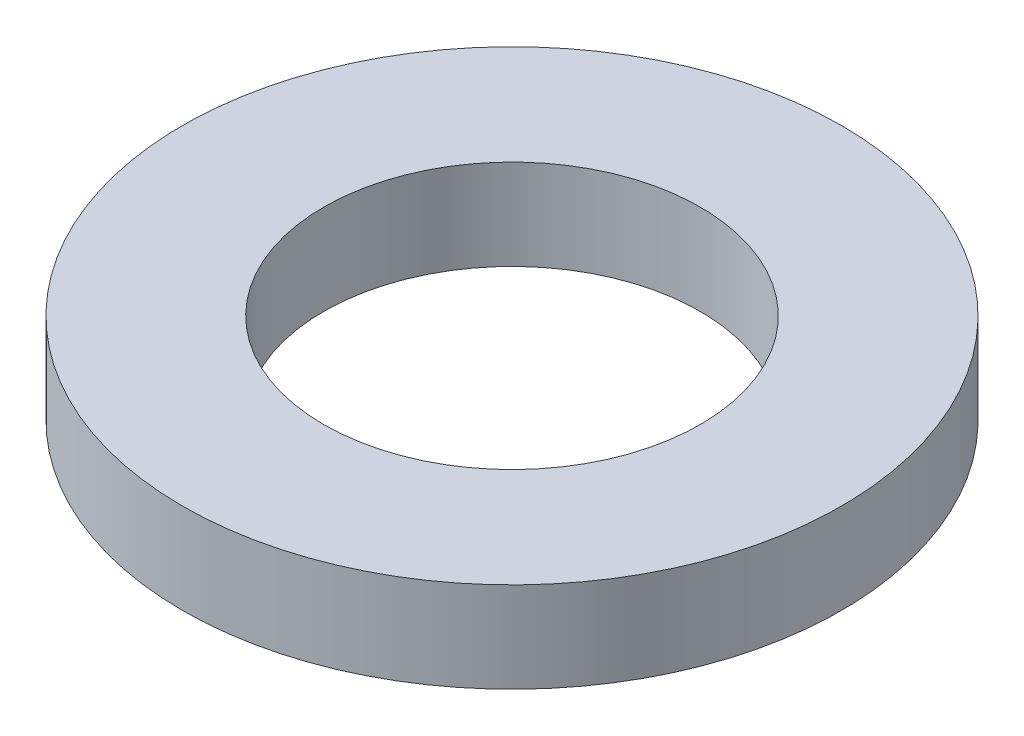
ISO-10303-21;
HEADER;
FILE_DESCRIPTION(('STEP AP214'),'2;1');
FILE_NAME('part.step','',(''),(''),'','','');
FILE_SCHEMA(('AUTOMOTIVE_DESIGN { 1 0 10303 214 1 1 1 1 }'));
ENDSEC;
DATA;
#1=APPLICATION_CONTEXT('core data for automotive mechanical design processes');
#2=APPLICATION_PROTOCOL_DEFINITION('international standard','automotive_design',2000,#1);
#3=PRODUCT_CONTEXT('',#1,'mechanical');
#4=PRODUCT('Part','Part','',(#3));
#5=PRODUCT_RELATED_PRODUCT_CATEGORY('part','',(#4));
#6=PRODUCT_DEFINITION_FORMATION('','',#4);
#7=PRODUCT_DEFINITION_CONTEXT('part definition',#1,'design');
#8=PRODUCT_DEFINITION('design','',#6,#7);
#9=PRODUCT_DEFINITION_SHAPE('','',#8);
#10=(LENGTH_UNIT() NAMED_UNIT(*) SI_UNIT(.MILLI.,.METRE.));
#11=(NAMED_UNIT(*) PLANE_ANGLE_UNIT() SI_UNIT($,.RADIAN.));
#12=(NAMED_UNIT(*) SI_UNIT($,.STERADIAN.) SOLID_ANGLE_UNIT());
#13=UNCERTAINTY_MEASURE_WITH_UNIT(LENGTH_MEASURE(1.E-05),#10,'distance_accuracy_value','');
#14=(GEOMETRIC_REPRESENTATION_CONTEXT(3) GLOBAL_UNCERTAINTY_ASSIGNED_CONTEXT((#13)) GLOBAL_UNIT_ASSIGNED_CONTEXT((#10,
#11,#12)) REPRESENTATION_CONTEXT('',''));
#15=CARTESIAN_POINT('',(0.,0.,0.));
#16=DIRECTION('',(0.,0.,1.));
#17=DIRECTION('',(1.,0.,0.));
#18=AXIS2_PLACEMENT_3D('',#15,#16,#17);
#19=CARTESIAN_POINT('',(0.,24.,0.));
#20=DIRECTION('',(0.,-1.,0.));
#21=DIRECTION('',(0.,0.,-1.));
#22=AXIS2_PLACEMENT_3D('',#19,#20,#21);
#23=CYLINDRICAL_SURFACE('',#22,87.5);
#24=CARTESIAN_POINT('',(0.,24.,0.));
#25=DIRECTION('',(0.,1.,0.));
#26=DIRECTION('',(0.,0.,1.));
#27=AXIS2_PLACEMENT_3D('',#24,#25,#26);
#28=CIRCLE('',#27,87.5);
#29=CARTESIAN_POINT('',(0.,24.,87.5));
#30=VERTEX_POINT('',#29);
#31=EDGE_CURVE('E10',#30,#30,#28,.T.);
#32=ORIENTED_EDGE('',*,*,#31,.F.);
#33=EDGE_LOOP('',(#32));
#34=FACE_BOUND('',#33,.T.);
#35=CARTESIAN_POINT('',(0.,0.,0.));
#36=DIRECTION('',(0.,1.,0.));
#37=DIRECTION('',(0.,0.,1.));
#38=AXIS2_PLACEMENT_3D('',#35,#36,#37);
#39=CIRCLE('',#38,87.5);
#40=CARTESIAN_POINT('',(0.,0.,87.5));
#41=VERTEX_POINT('',#40);
#42=EDGE_CURVE('E37',#41,#41,#39,.T.);
#43=ORIENTED_EDGE('',*,*,#42,.T.);
#44=EDGE_LOOP('',(#43));
#45=FACE_BOUND('',#44,.T.);
#46=ADVANCED_FACE('F40',(#34,#45),#23,.T.);
#47=CARTESIAN_POINT('',(0.,24.,0.));
#48=DIRECTION('',(0.,1.,0.));
#49=DIRECTION('',(0.,0.,1.));
#50=AXIS2_PLACEMENT_3D('',#47,#48,#49);
#51=PLANE('',#50);
#52=CARTESIAN_POINT('',(0.,24.,0.));
#53=DIRECTION('',(0.,1.,0.));
#54=DIRECTION('',(0.,0.,1.));
#55=AXIS2_PLACEMENT_3D('',#52,#53,#54);
#56=CIRCLE('',#55,50.);
#57=CARTESIAN_POINT('',(0.,24.,50.));
#58=VERTEX_POINT('',#57);
#59=EDGE_CURVE('E50',#58,#58,#56,.T.);
#60=ORIENTED_EDGE('',*,*,#59,.F.);
#61=EDGE_LOOP('',(#60));
#62=FACE_BOUND('',#61,.T.);
#63=ORIENTED_EDGE('',*,*,#31,.T.);
#64=EDGE_LOOP('',(#63));
#65=FACE_BOUND('',#64,.T.);
#66=ADVANCED_FACE('F59',(#62,#65),#51,.T.);
#67=CARTESIAN_POINT('',(0.,0.,0.));
#68=DIRECTION('',(0.,1.,0.));
#69=DIRECTION('',(0.,0.,1.));
#70=AXIS2_PLACEMENT_3D('',#67,#68,#69);
#71=PLANE('',#70);
#72=CARTESIAN_POINT('',(0.,0.,0.));
#73=DIRECTION('',(0.,1.,0.));
#74=DIRECTION('',(0.,0.,1.));
#75=AXIS2_PLACEMENT_3D('',#72,#73,#74);
#76=CIRCLE('',#75,50.);
#77=CARTESIAN_POINT('',(0.,0.,50.));
#78=VERTEX_POINT('',#77);
#79=EDGE_CURVE('E47',#78,#78,#76,.T.);
#80=ORIENTED_EDGE('',*,*,#79,.T.);
#81=EDGE_LOOP('',(#80));
#82=FACE_BOUND('',#81,.T.);
#83=ORIENTED_EDGE('',*,*,#42,.F.);
#84=EDGE_LOOP('',(#83));
#85=FACE_BOUND('',#84,.T.);
#86=ADVANCED_FACE('F58',(#82,#85),#71,.F.);
#87=CARTESIAN_POINT('',(0.,24.,0.));
#88=DIRECTION('',(0.,-1.,0.));
#89=DIRECTION('',(0.,0.,-1.));
#90=AXIS2_PLACEMENT_3D('',#87,#88,#89);
#91=CYLINDRICAL_SURFACE('',#90,50.);
#92=ORIENTED_EDGE('',*,*,#59,.T.);
#93=EDGE_LOOP('',(#92));
#94=FACE_BOUND('',#93,.T.);
#95=ORIENTED_EDGE('',*,*,#79,.F.);
#96=EDGE_LOOP('',(#95));
#97=FACE_BOUND('',#96,.T.);
#98=ADVANCED_FACE('F54',(#94,#97),#91,.F.);
#99=CLOSED_SHELL('',(#46,#66,#86,#98));
#100=MANIFOLD_SOLID_BREP('B2',#99);
#101=ADVANCED_BREP_SHAPE_REPRESENTATION('',(#18,#100),#14);
#102=SHAPE_DEFINITION_REPRESENTATION(#9,#101);
ENDSEC;
END-ISO-10303-21;
